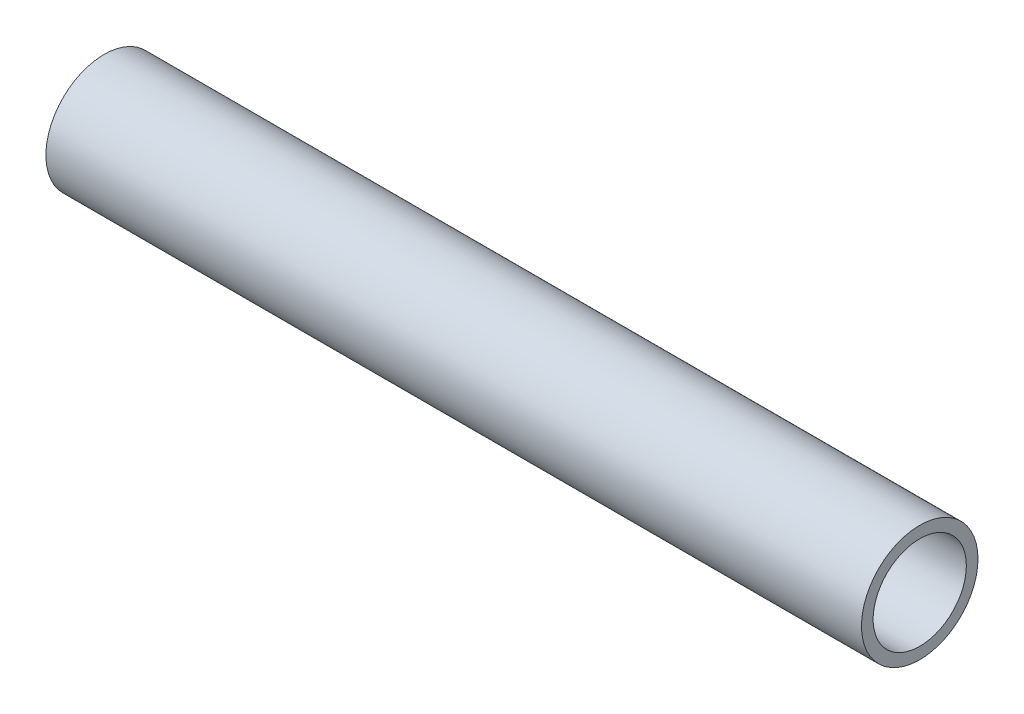
ISO-10303-21;
HEADER;
FILE_DESCRIPTION(('STEP AP214'),'2;1');
FILE_NAME('part.step','',(''),(''),'','','');
FILE_SCHEMA(('AUTOMOTIVE_DESIGN { 1 0 10303 214 1 1 1 1 }'));
ENDSEC;
DATA;
#1=APPLICATION_CONTEXT('core data for automotive mechanical design processes');
#2=APPLICATION_PROTOCOL_DEFINITION('international standard','automotive_design',2000,#1);
#3=PRODUCT_CONTEXT('',#1,'mechanical');
#4=PRODUCT('Part','Part','',(#3));
#5=PRODUCT_RELATED_PRODUCT_CATEGORY('part','',(#4));
#6=PRODUCT_DEFINITION_FORMATION('','',#4);
#7=PRODUCT_DEFINITION_CONTEXT('part definition',#1,'design');
#8=PRODUCT_DEFINITION('design','',#6,#7);
#9=PRODUCT_DEFINITION_SHAPE('','',#8);
#10=(LENGTH_UNIT() NAMED_UNIT(*) SI_UNIT(.MILLI.,.METRE.));
#11=(NAMED_UNIT(*) PLANE_ANGLE_UNIT() SI_UNIT($,.RADIAN.));
#12=(NAMED_UNIT(*) SI_UNIT($,.STERADIAN.) SOLID_ANGLE_UNIT());
#13=UNCERTAINTY_MEASURE_WITH_UNIT(LENGTH_MEASURE(1.E-05),#10,'distance_accuracy_value','');
#14=(GEOMETRIC_REPRESENTATION_CONTEXT(3) GLOBAL_UNCERTAINTY_ASSIGNED_CONTEXT((#13)) GLOBAL_UNIT_ASSIGNED_CONTEXT((#10,
#11,#12)) REPRESENTATION_CONTEXT('',''));
#15=CARTESIAN_POINT('',(0.,0.,0.));
#16=DIRECTION('',(0.,0.,1.));
#17=DIRECTION('',(1.,0.,0.));
#18=AXIS2_PLACEMENT_3D('',#15,#16,#17);
#19=CARTESIAN_POINT('',(70.,0.,0.));
#20=DIRECTION('',(1.,0.,0.));
#21=DIRECTION('',(0.,0.,-1.));
#22=AXIS2_PLACEMENT_3D('',#19,#20,#21);
#23=PLANE('',#22);
#24=CARTESIAN_POINT('',(70.,0.,0.));
#25=DIRECTION('',(1.,0.,0.));
#26=DIRECTION('',(0.,0.,-1.));
#27=AXIS2_PLACEMENT_3D('',#24,#25,#26);
#28=CIRCLE('',#27,5.);
#29=CARTESIAN_POINT('',(70.,0.,-5.));
#30=VERTEX_POINT('',#29);
#31=EDGE_CURVE('E10',#30,#30,#28,.T.);
#32=ORIENTED_EDGE('',*,*,#31,.T.);
#33=EDGE_LOOP('',(#32));
#34=FACE_BOUND('',#33,.T.);
#35=CARTESIAN_POINT('',(70.,0.,0.));
#36=DIRECTION('',(1.,0.,0.));
#37=DIRECTION('',(0.,0.,-1.));
#38=AXIS2_PLACEMENT_3D('',#35,#36,#37);
#39=CIRCLE('',#38,4.);
#40=CARTESIAN_POINT('',(70.,0.,-4.));
#41=VERTEX_POINT('',#40);
#42=EDGE_CURVE('E42',#41,#41,#39,.T.);
#43=ORIENTED_EDGE('',*,*,#42,.F.);
#44=EDGE_LOOP('',(#43));
#45=FACE_BOUND('',#44,.T.);
#46=ADVANCED_FACE('F31',(#34,#45),#23,.T.);
#47=CARTESIAN_POINT('',(0.,0.,0.));
#48=DIRECTION('',(1.,0.,0.));
#49=DIRECTION('',(0.,0.,-1.));
#50=AXIS2_PLACEMENT_3D('',#47,#48,#49);
#51=PLANE('',#50);
#52=CARTESIAN_POINT('',(0.,0.,0.));
#53=DIRECTION('',(1.,0.,0.));
#54=DIRECTION('',(0.,0.,-1.));
#55=AXIS2_PLACEMENT_3D('',#52,#53,#54);
#56=CIRCLE('',#55,5.);
#57=CARTESIAN_POINT('',(0.,0.,-5.));
#58=VERTEX_POINT('',#57);
#59=EDGE_CURVE('E35',#58,#58,#56,.T.);
#60=ORIENTED_EDGE('',*,*,#59,.F.);
#61=EDGE_LOOP('',(#60));
#62=FACE_BOUND('',#61,.T.);
#63=CARTESIAN_POINT('',(0.,0.,0.));
#64=DIRECTION('',(1.,0.,0.));
#65=DIRECTION('',(0.,0.,-1.));
#66=AXIS2_PLACEMENT_3D('',#63,#64,#65);
#67=CIRCLE('',#66,4.);
#68=CARTESIAN_POINT('',(0.,0.,-4.));
#69=VERTEX_POINT('',#68);
#70=EDGE_CURVE('E44',#69,#69,#67,.T.);
#71=ORIENTED_EDGE('',*,*,#70,.T.);
#72=EDGE_LOOP('',(#71));
#73=FACE_BOUND('',#72,.T.);
#74=ADVANCED_FACE('F54',(#62,#73),#51,.F.);
#75=CARTESIAN_POINT('',(70.,0.,0.));
#76=DIRECTION('',(-1.,0.,0.));
#77=DIRECTION('',(0.,0.,1.));
#78=AXIS2_PLACEMENT_3D('',#75,#76,#77);
#79=CYLINDRICAL_SURFACE('',#78,5.);
#80=ORIENTED_EDGE('',*,*,#31,.F.);
#81=EDGE_LOOP('',(#80));
#82=FACE_BOUND('',#81,.T.);
#83=ORIENTED_EDGE('',*,*,#59,.T.);
#84=EDGE_LOOP('',(#83));
#85=FACE_BOUND('',#84,.T.);
#86=ADVANCED_FACE('F33',(#82,#85),#79,.T.);
#87=CARTESIAN_POINT('',(70.,0.,0.));
#88=DIRECTION('',(-1.,0.,0.));
#89=DIRECTION('',(0.,0.,1.));
#90=AXIS2_PLACEMENT_3D('',#87,#88,#89);
#91=CYLINDRICAL_SURFACE('',#90,4.);
#92=ORIENTED_EDGE('',*,*,#42,.T.);
#93=EDGE_LOOP('',(#92));
#94=FACE_BOUND('',#93,.T.);
#95=ORIENTED_EDGE('',*,*,#70,.F.);
#96=EDGE_LOOP('',(#95));
#97=FACE_BOUND('',#96,.T.);
#98=ADVANCED_FACE('F50',(#94,#97),#91,.F.);
#99=CLOSED_SHELL('',(#46,#74,#86,#98));
#100=MANIFOLD_SOLID_BREP('B2',#99);
#101=ADVANCED_BREP_SHAPE_REPRESENTATION('',(#18,#100),#14);
#102=SHAPE_DEFINITION_REPRESENTATION(#9,#101);
ENDSEC;
END-ISO-10303-21;
